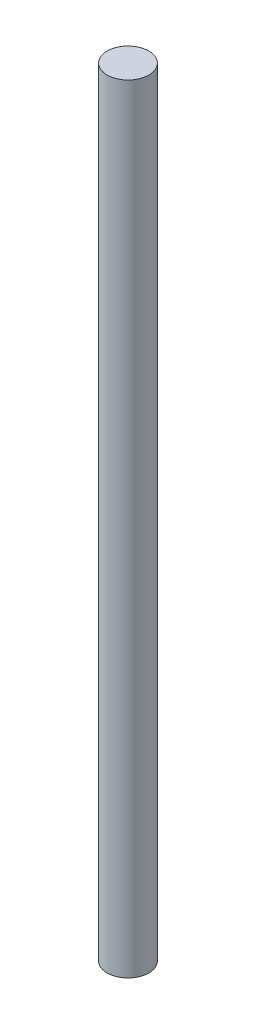
ISO-10303-21;
HEADER;
FILE_DESCRIPTION(('STEP AP214'),'2;1');
FILE_NAME('part.step','',(''),(''),'','','');
FILE_SCHEMA(('AUTOMOTIVE_DESIGN { 1 0 10303 214 1 1 1 1 }'));
ENDSEC;
DATA;
#1=APPLICATION_CONTEXT('core data for automotive mechanical design processes');
#2=APPLICATION_PROTOCOL_DEFINITION('international standard','automotive_design',2000,#1);
#3=PRODUCT_CONTEXT('',#1,'mechanical');
#4=PRODUCT('Part','Part','',(#3));
#5=PRODUCT_RELATED_PRODUCT_CATEGORY('part','',(#4));
#6=PRODUCT_DEFINITION_FORMATION('','',#4);
#7=PRODUCT_DEFINITION_CONTEXT('part definition',#1,'design');
#8=PRODUCT_DEFINITION('design','',#6,#7);
#9=PRODUCT_DEFINITION_SHAPE('','',#8);
#10=(LENGTH_UNIT() NAMED_UNIT(*) SI_UNIT(.MILLI.,.METRE.));
#11=(NAMED_UNIT(*) PLANE_ANGLE_UNIT() SI_UNIT($,.RADIAN.));
#12=(NAMED_UNIT(*) SI_UNIT($,.STERADIAN.) SOLID_ANGLE_UNIT());
#13=UNCERTAINTY_MEASURE_WITH_UNIT(LENGTH_MEASURE(1.E-05),#10,'distance_accuracy_value','');
#14=(GEOMETRIC_REPRESENTATION_CONTEXT(3) GLOBAL_UNCERTAINTY_ASSIGNED_CONTEXT((#13)) GLOBAL_UNIT_ASSIGNED_CONTEXT((#10,
#11,#12)) REPRESENTATION_CONTEXT('',''));
#15=CARTESIAN_POINT('',(0.,0.,0.));
#16=DIRECTION('',(0.,0.,1.));
#17=DIRECTION('',(1.,0.,0.));
#18=AXIS2_PLACEMENT_3D('',#15,#16,#17);
#19=CARTESIAN_POINT('',(0.,177.8,0.));
#20=DIRECTION('',(0.,-1.,0.));
#21=DIRECTION('',(0.,0.,-1.));
#22=AXIS2_PLACEMENT_3D('',#19,#20,#21);
#23=CYLINDRICAL_SURFACE('',#22,4.7625);
#24=CARTESIAN_POINT('',(0.,177.8,0.));
#25=DIRECTION('',(0.,1.,0.));
#26=DIRECTION('',(0.,0.,1.));
#27=AXIS2_PLACEMENT_3D('',#24,#25,#26);
#28=CIRCLE('',#27,4.7625);
#29=CARTESIAN_POINT('',(0.,177.8,4.7625));
#30=VERTEX_POINT('',#29);
#31=EDGE_CURVE('E10',#30,#30,#28,.T.);
#32=ORIENTED_EDGE('',*,*,#31,.F.);
#33=EDGE_LOOP('',(#32));
#34=FACE_BOUND('',#33,.T.);
#35=CARTESIAN_POINT('',(0.,0.,0.));
#36=DIRECTION('',(0.,1.,0.));
#37=DIRECTION('',(0.,0.,1.));
#38=AXIS2_PLACEMENT_3D('',#35,#36,#37);
#39=CIRCLE('',#38,4.7625);
#40=CARTESIAN_POINT('',(0.,0.,4.7625));
#41=VERTEX_POINT('',#40);
#42=EDGE_CURVE('E34',#41,#41,#39,.T.);
#43=ORIENTED_EDGE('',*,*,#42,.T.);
#44=EDGE_LOOP('',(#43));
#45=FACE_BOUND('',#44,.T.);
#46=ADVANCED_FACE('F31',(#34,#45),#23,.T.);
#47=CARTESIAN_POINT('',(0.,177.8,0.));
#48=DIRECTION('',(0.,1.,0.));
#49=DIRECTION('',(0.,0.,1.));
#50=AXIS2_PLACEMENT_3D('',#47,#48,#49);
#51=PLANE('',#50);
#52=ORIENTED_EDGE('',*,*,#31,.T.);
#53=EDGE_LOOP('',(#52));
#54=FACE_BOUND('',#53,.T.);
#55=ADVANCED_FACE('F46',(#54),#51,.T.);
#56=CARTESIAN_POINT('',(0.,0.,0.));
#57=DIRECTION('',(0.,1.,0.));
#58=DIRECTION('',(0.,0.,1.));
#59=AXIS2_PLACEMENT_3D('',#56,#57,#58);
#60=PLANE('',#59);
#61=ORIENTED_EDGE('',*,*,#42,.F.);
#62=EDGE_LOOP('',(#61));
#63=FACE_BOUND('',#62,.T.);
#64=ADVANCED_FACE('F44',(#63),#60,.F.);
#65=CLOSED_SHELL('',(#46,#55,#64));
#66=MANIFOLD_SOLID_BREP('B2',#65);
#67=ADVANCED_BREP_SHAPE_REPRESENTATION('',(#18,#66),#14);
#68=SHAPE_DEFINITION_REPRESENTATION(#9,#67);
ENDSEC;
END-ISO-10303-21;
